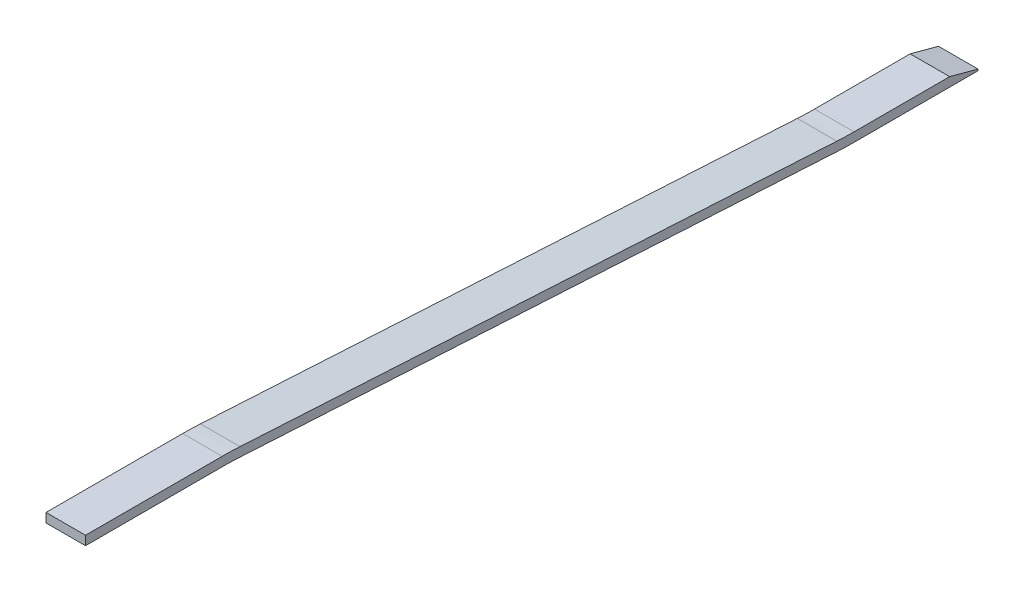
ISO-10303-21;
HEADER;
FILE_DESCRIPTION(('STEP AP214'),'2;1');
FILE_NAME('part.step','',(''),(''),'','','');
FILE_SCHEMA(('AUTOMOTIVE_DESIGN { 1 0 10303 214 1 1 1 1 }'));
ENDSEC;
DATA;
#1=APPLICATION_CONTEXT('core data for automotive mechanical design processes');
#2=APPLICATION_PROTOCOL_DEFINITION('international standard','automotive_design',2000,#1);
#3=PRODUCT_CONTEXT('',#1,'mechanical');
#4=PRODUCT('Part','Part','',(#3));
#5=PRODUCT_RELATED_PRODUCT_CATEGORY('part','',(#4));
#6=PRODUCT_DEFINITION_FORMATION('','',#4);
#7=PRODUCT_DEFINITION_CONTEXT('part definition',#1,'design');
#8=PRODUCT_DEFINITION('design','',#6,#7);
#9=PRODUCT_DEFINITION_SHAPE('','',#8);
#10=(LENGTH_UNIT() NAMED_UNIT(*) SI_UNIT(.MILLI.,.METRE.));
#11=(NAMED_UNIT(*) PLANE_ANGLE_UNIT() SI_UNIT($,.RADIAN.));
#12=(NAMED_UNIT(*) SI_UNIT($,.STERADIAN.) SOLID_ANGLE_UNIT());
#13=UNCERTAINTY_MEASURE_WITH_UNIT(LENGTH_MEASURE(1.E-05),#10,'distance_accuracy_value','');
#14=(GEOMETRIC_REPRESENTATION_CONTEXT(3) GLOBAL_UNCERTAINTY_ASSIGNED_CONTEXT((#13)) GLOBAL_UNIT_ASSIGNED_CONTEXT((#10,
#11,#12)) REPRESENTATION_CONTEXT('',''));
#15=CARTESIAN_POINT('',(0.,0.,0.));
#16=DIRECTION('',(0.,0.,1.));
#17=DIRECTION('',(1.,0.,0.));
#18=AXIS2_PLACEMENT_3D('',#15,#16,#17);
#19=CARTESIAN_POINT('',(6.5,14.,-55.));
#20=DIRECTION('',(0.,0.,-1.));
#21=DIRECTION('',(-1.,0.,0.));
#22=AXIS2_PLACEMENT_3D('',#19,#20,#21);
#23=PLANE('',#22);
#24=DIRECTION('',(0.,-1.,0.));
#25=VECTOR('',#24,1.);
#26=CARTESIAN_POINT('',(-6.5,14.,-55.));
#27=LINE('',#26,#25);
#28=CARTESIAN_POINT('',(-6.5,17.,-55.));
#29=VERTEX_POINT('',#28);
#30=CARTESIAN_POINT('',(-6.5,14.,-55.));
#31=VERTEX_POINT('',#30);
#32=EDGE_CURVE('E129',#29,#31,#27,.T.);
#33=ORIENTED_EDGE('',*,*,#32,.T.);
#34=DIRECTION('',(-1.,0.,0.));
#35=VECTOR('',#34,1.);
#36=CARTESIAN_POINT('',(6.5,14.,-55.));
#37=LINE('',#36,#35);
#38=CARTESIAN_POINT('',(6.5,14.,-55.));
#39=VERTEX_POINT('',#38);
#40=EDGE_CURVE('E11',#39,#31,#37,.T.);
#41=ORIENTED_EDGE('',*,*,#40,.F.);
#42=DIRECTION('',(0.,-1.,0.));
#43=VECTOR('',#42,1.);
#44=CARTESIAN_POINT('',(6.5,14.,-55.));
#45=LINE('',#44,#43);
#46=CARTESIAN_POINT('',(6.5,17.,-55.));
#47=VERTEX_POINT('',#46);
#48=EDGE_CURVE('E166',#47,#39,#45,.T.);
#49=ORIENTED_EDGE('',*,*,#48,.F.);
#50=DIRECTION('',(-1.,0.,0.));
#51=VECTOR('',#50,1.);
#52=CARTESIAN_POINT('',(6.5,17.,-55.));
#53=LINE('',#52,#51);
#54=EDGE_CURVE('E142',#47,#29,#53,.T.);
#55=ORIENTED_EDGE('',*,*,#54,.T.);
#56=EDGE_LOOP('',(#33,#41,#49,#55));
#57=FACE_BOUND('',#56,.T.);
#58=ADVANCED_FACE('F31',(#57),#23,.F.);
#59=CARTESIAN_POINT('',(6.5,14.,-55.));
#60=DIRECTION('',(0.,1.,0.));
#61=DIRECTION('',(0.,0.,1.));
#62=AXIS2_PLACEMENT_3D('',#59,#60,#61);
#63=PLANE('',#62);
#64=DIRECTION('',(0.,0.,-1.));
#65=VECTOR('',#64,1.);
#66=CARTESIAN_POINT('',(-6.5,14.,-55.));
#67=LINE('',#66,#65);
#68=CARTESIAN_POINT('',(-6.5,14.,-100.));
#69=VERTEX_POINT('',#68);
#70=EDGE_CURVE('E125',#31,#69,#67,.T.);
#71=ORIENTED_EDGE('',*,*,#70,.T.);
#72=DIRECTION('',(-1.,0.,0.));
#73=VECTOR('',#72,1.);
#74=CARTESIAN_POINT('',(6.5,14.,-100.));
#75=LINE('',#74,#73);
#76=CARTESIAN_POINT('',(6.5,14.,-100.));
#77=VERTEX_POINT('',#76);
#78=EDGE_CURVE('E38',#77,#69,#75,.T.);
#79=ORIENTED_EDGE('',*,*,#78,.F.);
#80=DIRECTION('',(0.,0.,-1.));
#81=VECTOR('',#80,1.);
#82=CARTESIAN_POINT('',(6.5,14.,-55.));
#83=LINE('',#82,#81);
#84=EDGE_CURVE('E138',#39,#77,#83,.T.);
#85=ORIENTED_EDGE('',*,*,#84,.F.);
#86=ORIENTED_EDGE('',*,*,#40,.T.);
#87=EDGE_LOOP('',(#71,#79,#85,#86));
#88=FACE_BOUND('',#87,.T.);
#89=ADVANCED_FACE('F137',(#88),#63,.F.);
#90=CARTESIAN_POINT('',(6.5,-86.,-100.));
#91=DIRECTION('',(-1.,0.,0.));
#92=DIRECTION('',(0.,0.,1.));
#93=AXIS2_PLACEMENT_3D('',#90,#91,#92);
#94=CYLINDRICAL_SURFACE('',#93,100.);
#95=CARTESIAN_POINT('',(-6.5,-86.,-100.));
#96=DIRECTION('',(-1.,0.,0.));
#97=DIRECTION('',(0.,0.,1.));
#98=AXIS2_PLACEMENT_3D('',#95,#96,#97);
#99=CIRCLE('',#98,100.);
#100=CARTESIAN_POINT('',(-6.5,13.8387088313527,-105.677342590365));
#101=VERTEX_POINT('',#100);
#102=EDGE_CURVE('E131',#69,#101,#99,.T.);
#103=ORIENTED_EDGE('',*,*,#102,.T.);
#104=DIRECTION('',(-1.,0.,0.));
#105=VECTOR('',#104,1.);
#106=CARTESIAN_POINT('',(6.5,13.8387088313527,-105.677342590365));
#107=LINE('',#106,#105);
#108=CARTESIAN_POINT('',(6.5,13.8387088313527,-105.677342590365));
#109=VERTEX_POINT('',#108);
#110=EDGE_CURVE('E217',#109,#101,#107,.T.);
#111=ORIENTED_EDGE('',*,*,#110,.F.);
#112=CARTESIAN_POINT('',(6.5,-86.,-100.));
#113=DIRECTION('',(-1.,0.,0.));
#114=DIRECTION('',(0.,0.,1.));
#115=AXIS2_PLACEMENT_3D('',#112,#113,#114);
#116=CIRCLE('',#115,100.);
#117=EDGE_CURVE('E169',#77,#109,#116,.T.);
#118=ORIENTED_EDGE('',*,*,#117,.F.);
#119=ORIENTED_EDGE('',*,*,#78,.T.);
#120=EDGE_LOOP('',(#103,#111,#118,#119));
#121=FACE_BOUND('',#120,.T.);
#122=ADVANCED_FACE('F221',(#121),#94,.F.);
#123=CARTESIAN_POINT('',(6.5,13.8387088313527,-105.677342590365));
#124=DIRECTION('',(0.,0.998387088313527,-0.0567734259036518));
#125=DIRECTION('',(0.,0.0567734259036518,0.998387088313527));
#126=AXIS2_PLACEMENT_3D('',#123,#124,#125);
#127=PLANE('',#126);
#128=DIRECTION('',(0.,-0.0567734259036518,-0.998387088313527));
#129=VECTOR('',#128,1.);
#130=CARTESIAN_POINT('',(-6.5,13.8387088313527,-105.677342590365));
#131=LINE('',#130,#129);
#132=CARTESIAN_POINT('',(-6.5,2.66612990370668,-302.152337131924));
#133=VERTEX_POINT('',#132);
#134=EDGE_CURVE('E146',#101,#133,#131,.T.);
#135=ORIENTED_EDGE('',*,*,#134,.T.);
#136=DIRECTION('',(-1.,0.,0.));
#137=VECTOR('',#136,1.);
#138=CARTESIAN_POINT('',(6.5,2.66612990370668,-302.152337131924));
#139=LINE('',#138,#137);
#140=CARTESIAN_POINT('',(6.5,2.66612990370668,-302.152337131924));
#141=VERTEX_POINT('',#140);
#142=EDGE_CURVE('E214',#141,#133,#139,.T.);
#143=ORIENTED_EDGE('',*,*,#142,.F.);
#144=DIRECTION('',(0.,-0.0567734259036518,-0.998387088313527));
#145=VECTOR('',#144,1.);
#146=CARTESIAN_POINT('',(6.5,13.8387088313527,-105.677342590365));
#147=LINE('',#146,#145);
#148=EDGE_CURVE('E171',#109,#141,#147,.T.);
#149=ORIENTED_EDGE('',*,*,#148,.F.);
#150=ORIENTED_EDGE('',*,*,#110,.T.);
#151=EDGE_LOOP('',(#135,#143,#149,#150));
#152=FACE_BOUND('',#151,.T.);
#153=ADVANCED_FACE('F229',(#152),#127,.F.);
#154=CARTESIAN_POINT('',(6.5,105.5,-308.));
#155=DIRECTION('',(-1.,0.,0.));
#156=DIRECTION('',(0.,0.,1.));
#157=AXIS2_PLACEMENT_3D('',#154,#155,#156);
#158=CYLINDRICAL_SURFACE('',#157,103.);
#159=CARTESIAN_POINT('',(-6.5,105.5,-308.));
#160=DIRECTION('',(1.,0.,0.));
#161=DIRECTION('',(0.,0.,-1.));
#162=AXIS2_PLACEMENT_3D('',#159,#160,#161);
#163=CIRCLE('',#162,103.);
#164=CARTESIAN_POINT('',(-6.5,2.49999999999999,-308.));
#165=VERTEX_POINT('',#164);
#166=EDGE_CURVE('E148',#133,#165,#163,.T.);
#167=ORIENTED_EDGE('',*,*,#166,.T.);
#168=DIRECTION('',(-1.,0.,0.));
#169=VECTOR('',#168,1.);
#170=CARTESIAN_POINT('',(6.5,2.49999999999999,-308.));
#171=LINE('',#170,#169);
#172=CARTESIAN_POINT('',(6.5,2.49999999999999,-308.));
#173=VERTEX_POINT('',#172);
#174=EDGE_CURVE('E211',#173,#165,#171,.T.);
#175=ORIENTED_EDGE('',*,*,#174,.F.);
#176=CARTESIAN_POINT('',(6.5,105.5,-308.));
#177=DIRECTION('',(1.,0.,0.));
#178=DIRECTION('',(0.,0.,-1.));
#179=AXIS2_PLACEMENT_3D('',#176,#177,#178);
#180=CIRCLE('',#179,103.);
#181=EDGE_CURVE('E173',#141,#173,#180,.T.);
#182=ORIENTED_EDGE('',*,*,#181,.F.);
#183=ORIENTED_EDGE('',*,*,#142,.T.);
#184=EDGE_LOOP('',(#167,#175,#182,#183));
#185=FACE_BOUND('',#184,.T.);
#186=ADVANCED_FACE('F232',(#185),#158,.T.);
#187=CARTESIAN_POINT('',(6.5,2.5,-308.));
#188=DIRECTION('',(0.,1.,0.));
#189=DIRECTION('',(0.,0.,1.));
#190=AXIS2_PLACEMENT_3D('',#187,#188,#189);
#191=PLANE('',#190);
#192=DIRECTION('',(0.,0.,-1.));
#193=VECTOR('',#192,1.);
#194=CARTESIAN_POINT('',(-6.5,2.5,-308.));
#195=LINE('',#194,#193);
#196=CARTESIAN_POINT('',(-6.5,2.5,-348.803847577293));
#197=VERTEX_POINT('',#196);
#198=EDGE_CURVE('E150',#165,#197,#195,.T.);
#199=ORIENTED_EDGE('',*,*,#198,.T.);
#200=DIRECTION('',(-1.,0.,0.));
#201=VECTOR('',#200,1.);
#202=CARTESIAN_POINT('',(6.5,2.5,-348.803847577293));
#203=LINE('',#202,#201);
#204=CARTESIAN_POINT('',(6.5,2.5,-348.803847577293));
#205=VERTEX_POINT('',#204);
#206=EDGE_CURVE('E208',#205,#197,#203,.T.);
#207=ORIENTED_EDGE('',*,*,#206,.F.);
#208=DIRECTION('',(0.,0.,-1.));
#209=VECTOR('',#208,1.);
#210=CARTESIAN_POINT('',(6.5,2.5,-308.));
#211=LINE('',#210,#209);
#212=EDGE_CURVE('E175',#173,#205,#211,.T.);
#213=ORIENTED_EDGE('',*,*,#212,.F.);
#214=ORIENTED_EDGE('',*,*,#174,.T.);
#215=EDGE_LOOP('',(#199,#207,#213,#214));
#216=FACE_BOUND('',#215,.T.);
#217=ADVANCED_FACE('F237',(#216),#191,.F.);
#218=CARTESIAN_POINT('',(6.5,2.5,-348.803847577293));
#219=DIRECTION('',(0.,0.,1.));
#220=DIRECTION('',(1.,0.,0.));
#221=AXIS2_PLACEMENT_3D('',#218,#219,#220);
#222=PLANE('',#221);
#223=DIRECTION('',(0.,1.,0.));
#224=VECTOR('',#223,1.);
#225=CARTESIAN_POINT('',(-6.5,2.5,-348.803847577293));
#226=LINE('',#225,#224);
#227=CARTESIAN_POINT('',(-6.5,3.,-348.803847577293));
#228=VERTEX_POINT('',#227);
#229=EDGE_CURVE('E152',#197,#228,#226,.T.);
#230=ORIENTED_EDGE('',*,*,#229,.T.);
#231=DIRECTION('',(-1.,0.,0.));
#232=VECTOR('',#231,1.);
#233=CARTESIAN_POINT('',(6.5,3.,-348.803847577293));
#234=LINE('',#233,#232);
#235=CARTESIAN_POINT('',(6.5,3.,-348.803847577293));
#236=VERTEX_POINT('',#235);
#237=EDGE_CURVE('E205',#236,#228,#234,.T.);
#238=ORIENTED_EDGE('',*,*,#237,.F.);
#239=DIRECTION('',(0.,1.,0.));
#240=VECTOR('',#239,1.);
#241=CARTESIAN_POINT('',(6.5,2.5,-348.803847577293));
#242=LINE('',#241,#240);
#243=EDGE_CURVE('E177',#205,#236,#242,.T.);
#244=ORIENTED_EDGE('',*,*,#243,.F.);
#245=ORIENTED_EDGE('',*,*,#206,.T.);
#246=EDGE_LOOP('',(#230,#238,#244,#245));
#247=FACE_BOUND('',#246,.T.);
#248=ADVANCED_FACE('F243',(#247),#222,.F.);
#249=CARTESIAN_POINT('',(6.5,3.,-348.803847577293));
#250=DIRECTION('',(0.,-0.96592582628907,0.258819045102515));
#251=DIRECTION('',(0.,-0.258819045102515,-0.96592582628907));
#252=AXIS2_PLACEMENT_3D('',#249,#250,#251);
#253=PLANE('',#252);
#254=DIRECTION('',(0.,0.258819045102515,0.96592582628907));
#255=VECTOR('',#254,1.);
#256=CARTESIAN_POINT('',(-6.5,3.,-348.803847577293));
#257=LINE('',#256,#255);
#258=CARTESIAN_POINT('',(-6.5,5.49999999999999,-339.473720558371));
#259=VERTEX_POINT('',#258);
#260=EDGE_CURVE('E154',#228,#259,#257,.T.);
#261=ORIENTED_EDGE('',*,*,#260,.T.);
#262=DIRECTION('',(-1.,0.,0.));
#263=VECTOR('',#262,1.);
#264=CARTESIAN_POINT('',(6.5,5.49999999999999,-339.473720558371));
#265=LINE('',#264,#263);
#266=CARTESIAN_POINT('',(6.5,5.49999999999999,-339.473720558371));
#267=VERTEX_POINT('',#266);
#268=EDGE_CURVE('E202',#267,#259,#265,.T.);
#269=ORIENTED_EDGE('',*,*,#268,.F.);
#270=DIRECTION('',(0.,0.258819045102515,0.96592582628907));
#271=VECTOR('',#270,1.);
#272=CARTESIAN_POINT('',(6.5,3.,-348.803847577293));
#273=LINE('',#272,#271);
#274=EDGE_CURVE('E179',#236,#267,#273,.T.);
#275=ORIENTED_EDGE('',*,*,#274,.F.);
#276=ORIENTED_EDGE('',*,*,#237,.T.);
#277=EDGE_LOOP('',(#261,#269,#275,#276));
#278=FACE_BOUND('',#277,.T.);
#279=ADVANCED_FACE('F247',(#278),#253,.F.);
#280=CARTESIAN_POINT('',(6.5,5.49999999999998,-308.));
#281=DIRECTION('',(0.,-1.,0.));
#282=DIRECTION('',(0.,0.,-1.));
#283=AXIS2_PLACEMENT_3D('',#280,#281,#282);
#284=PLANE('',#283);
#285=DIRECTION('',(0.,0.,1.));
#286=VECTOR('',#285,1.);
#287=CARTESIAN_POINT('',(-6.5,5.49999999999998,-308.));
#288=LINE('',#287,#286);
#289=CARTESIAN_POINT('',(-6.5,5.49999999999998,-308.));
#290=VERTEX_POINT('',#289);
#291=EDGE_CURVE('E156',#259,#290,#288,.T.);
#292=ORIENTED_EDGE('',*,*,#291,.T.);
#293=DIRECTION('',(-1.,0.,0.));
#294=VECTOR('',#293,1.);
#295=CARTESIAN_POINT('',(6.5,5.49999999999998,-308.));
#296=LINE('',#295,#294);
#297=CARTESIAN_POINT('',(6.5,5.49999999999998,-308.));
#298=VERTEX_POINT('',#297);
#299=EDGE_CURVE('E199',#298,#290,#296,.T.);
#300=ORIENTED_EDGE('',*,*,#299,.F.);
#301=DIRECTION('',(0.,0.,1.));
#302=VECTOR('',#301,1.);
#303=CARTESIAN_POINT('',(6.5,5.49999999999998,-308.));
#304=LINE('',#303,#302);
#305=EDGE_CURVE('E181',#267,#298,#304,.T.);
#306=ORIENTED_EDGE('',*,*,#305,.F.);
#307=ORIENTED_EDGE('',*,*,#268,.T.);
#308=EDGE_LOOP('',(#292,#300,#306,#307));
#309=FACE_BOUND('',#308,.T.);
#310=ADVANCED_FACE('F252',(#309),#284,.F.);
#311=CARTESIAN_POINT('',(6.5,105.5,-308.));
#312=DIRECTION('',(-1.,0.,0.));
#313=DIRECTION('',(0.,0.,1.));
#314=AXIS2_PLACEMENT_3D('',#311,#312,#313);
#315=CYLINDRICAL_SURFACE('',#314,100.);
#316=CARTESIAN_POINT('',(-6.5,105.5,-308.));
#317=DIRECTION('',(-1.,0.,0.));
#318=DIRECTION('',(0.,0.,-1.));
#319=AXIS2_PLACEMENT_3D('',#316,#317,#318);
#320=CIRCLE('',#319,100.);
#321=CARTESIAN_POINT('',(-6.5,5.66129116864729,-302.322657409635));
#322=VERTEX_POINT('',#321);
#323=EDGE_CURVE('E158',#290,#322,#320,.T.);
#324=ORIENTED_EDGE('',*,*,#323,.T.);
#325=DIRECTION('',(-1.,0.,0.));
#326=VECTOR('',#325,1.);
#327=CARTESIAN_POINT('',(6.5,5.66129116864729,-302.322657409635));
#328=LINE('',#327,#326);
#329=CARTESIAN_POINT('',(6.5,5.66129116864729,-302.322657409635));
#330=VERTEX_POINT('',#329);
#331=EDGE_CURVE('E196',#330,#322,#328,.T.);
#332=ORIENTED_EDGE('',*,*,#331,.F.);
#333=CARTESIAN_POINT('',(6.5,105.5,-308.));
#334=DIRECTION('',(-1.,0.,0.));
#335=DIRECTION('',(0.,0.,-1.));
#336=AXIS2_PLACEMENT_3D('',#333,#334,#335);
#337=CIRCLE('',#336,100.);
#338=EDGE_CURVE('E183',#298,#330,#337,.T.);
#339=ORIENTED_EDGE('',*,*,#338,.F.);
#340=ORIENTED_EDGE('',*,*,#299,.T.);
#341=EDGE_LOOP('',(#324,#332,#339,#340));
#342=FACE_BOUND('',#341,.T.);
#343=ADVANCED_FACE('F258',(#342),#315,.F.);
#344=CARTESIAN_POINT('',(6.5,16.8338700962933,-105.847662868076));
#345=DIRECTION('',(0.,-0.998387088313527,0.0567734259036518));
#346=DIRECTION('',(0.,-0.0567734259036518,-0.998387088313527));
#347=AXIS2_PLACEMENT_3D('',#344,#345,#346);
#348=PLANE('',#347);
#349=DIRECTION('',(0.,0.0567734259036518,0.998387088313527));
#350=VECTOR('',#349,1.);
#351=CARTESIAN_POINT('',(-6.5,16.8338700962933,-105.847662868076));
#352=LINE('',#351,#350);
#353=CARTESIAN_POINT('',(-6.5,16.8338700962933,-105.847662868076));
#354=VERTEX_POINT('',#353);
#355=EDGE_CURVE('E160',#322,#354,#352,.T.);
#356=ORIENTED_EDGE('',*,*,#355,.T.);
#357=DIRECTION('',(-1.,0.,0.));
#358=VECTOR('',#357,1.);
#359=CARTESIAN_POINT('',(6.5,16.8338700962933,-105.847662868076));
#360=LINE('',#359,#358);
#361=CARTESIAN_POINT('',(6.5,16.8338700962933,-105.847662868076));
#362=VERTEX_POINT('',#361);
#363=EDGE_CURVE('E193',#362,#354,#360,.T.);
#364=ORIENTED_EDGE('',*,*,#363,.F.);
#365=DIRECTION('',(0.,0.0567734259036518,0.998387088313527));
#366=VECTOR('',#365,1.);
#367=CARTESIAN_POINT('',(6.5,16.8338700962933,-105.847662868076));
#368=LINE('',#367,#366);
#369=EDGE_CURVE('E185',#330,#362,#368,.T.);
#370=ORIENTED_EDGE('',*,*,#369,.F.);
#371=ORIENTED_EDGE('',*,*,#331,.T.);
#372=EDGE_LOOP('',(#356,#364,#370,#371));
#373=FACE_BOUND('',#372,.T.);
#374=ADVANCED_FACE('F262',(#373),#348,.F.);
#375=CARTESIAN_POINT('',(6.5,-86.,-100.));
#376=DIRECTION('',(-1.,0.,0.));
#377=DIRECTION('',(0.,0.,1.));
#378=AXIS2_PLACEMENT_3D('',#375,#376,#377);
#379=CYLINDRICAL_SURFACE('',#378,103.);
#380=CARTESIAN_POINT('',(-6.5,-86.,-100.));
#381=DIRECTION('',(1.,0.,0.));
#382=DIRECTION('',(0.,0.,1.));
#383=AXIS2_PLACEMENT_3D('',#380,#381,#382);
#384=CIRCLE('',#383,103.);
#385=CARTESIAN_POINT('',(-6.5,17.,-100.));
#386=VERTEX_POINT('',#385);
#387=EDGE_CURVE('E162',#354,#386,#384,.T.);
#388=ORIENTED_EDGE('',*,*,#387,.T.);
#389=DIRECTION('',(-1.,0.,0.));
#390=VECTOR('',#389,1.);
#391=CARTESIAN_POINT('',(6.5,17.,-100.));
#392=LINE('',#391,#390);
#393=CARTESIAN_POINT('',(6.5,17.,-100.));
#394=VERTEX_POINT('',#393);
#395=EDGE_CURVE('E190',#394,#386,#392,.T.);
#396=ORIENTED_EDGE('',*,*,#395,.F.);
#397=CARTESIAN_POINT('',(6.5,-86.,-100.));
#398=DIRECTION('',(1.,0.,0.));
#399=DIRECTION('',(0.,0.,1.));
#400=AXIS2_PLACEMENT_3D('',#397,#398,#399);
#401=CIRCLE('',#400,103.);
#402=EDGE_CURVE('E50',#362,#394,#401,.T.);
#403=ORIENTED_EDGE('',*,*,#402,.F.);
#404=ORIENTED_EDGE('',*,*,#363,.T.);
#405=EDGE_LOOP('',(#388,#396,#403,#404));
#406=FACE_BOUND('',#405,.T.);
#407=ADVANCED_FACE('F265',(#406),#379,.T.);
#408=CARTESIAN_POINT('',(6.5,17.,-55.));
#409=DIRECTION('',(0.,-1.,0.));
#410=DIRECTION('',(0.,0.,-1.));
#411=AXIS2_PLACEMENT_3D('',#408,#409,#410);
#412=PLANE('',#411);
#413=DIRECTION('',(0.,0.,1.));
#414=VECTOR('',#413,1.);
#415=CARTESIAN_POINT('',(-6.5,17.,-55.));
#416=LINE('',#415,#414);
#417=EDGE_CURVE('E164',#386,#29,#416,.T.);
#418=ORIENTED_EDGE('',*,*,#417,.T.);
#419=ORIENTED_EDGE('',*,*,#54,.F.);
#420=DIRECTION('',(0.,0.,1.));
#421=VECTOR('',#420,1.);
#422=CARTESIAN_POINT('',(6.5,17.,-55.));
#423=LINE('',#422,#421);
#424=EDGE_CURVE('E45',#394,#47,#423,.T.);
#425=ORIENTED_EDGE('',*,*,#424,.F.);
#426=ORIENTED_EDGE('',*,*,#395,.T.);
#427=EDGE_LOOP('',(#418,#419,#425,#426));
#428=FACE_BOUND('',#427,.T.);
#429=ADVANCED_FACE('F267',(#428),#412,.F.);
#430=CARTESIAN_POINT('',(6.5,-86.,-100.));
#431=DIRECTION('',(-1.,0.,0.));
#432=DIRECTION('',(0.,0.,1.));
#433=AXIS2_PLACEMENT_3D('',#430,#431,#432);
#434=PLANE('',#433);
#435=ORIENTED_EDGE('',*,*,#48,.T.);
#436=ORIENTED_EDGE('',*,*,#84,.T.);
#437=ORIENTED_EDGE('',*,*,#117,.T.);
#438=ORIENTED_EDGE('',*,*,#148,.T.);
#439=ORIENTED_EDGE('',*,*,#181,.T.);
#440=ORIENTED_EDGE('',*,*,#212,.T.);
#441=ORIENTED_EDGE('',*,*,#243,.T.);
#442=ORIENTED_EDGE('',*,*,#274,.T.);
#443=ORIENTED_EDGE('',*,*,#305,.T.);
#444=ORIENTED_EDGE('',*,*,#338,.T.);
#445=ORIENTED_EDGE('',*,*,#369,.T.);
#446=ORIENTED_EDGE('',*,*,#402,.T.);
#447=ORIENTED_EDGE('',*,*,#424,.T.);
#448=EDGE_LOOP('',(#435,#436,#437,#438,#439,#440,#441,#442,#443,#444,#445,#446,#447));
#449=FACE_BOUND('',#448,.T.);
#450=ADVANCED_FACE('F224',(#449),#434,.F.);
#451=CARTESIAN_POINT('',(-6.5,-86.,-100.));
#452=DIRECTION('',(-1.,0.,0.));
#453=DIRECTION('',(0.,0.,1.));
#454=AXIS2_PLACEMENT_3D('',#451,#452,#453);
#455=PLANE('',#454);
#456=ORIENTED_EDGE('',*,*,#32,.F.);
#457=ORIENTED_EDGE('',*,*,#417,.F.);
#458=ORIENTED_EDGE('',*,*,#387,.F.);
#459=ORIENTED_EDGE('',*,*,#355,.F.);
#460=ORIENTED_EDGE('',*,*,#323,.F.);
#461=ORIENTED_EDGE('',*,*,#291,.F.);
#462=ORIENTED_EDGE('',*,*,#260,.F.);
#463=ORIENTED_EDGE('',*,*,#229,.F.);
#464=ORIENTED_EDGE('',*,*,#198,.F.);
#465=ORIENTED_EDGE('',*,*,#166,.F.);
#466=ORIENTED_EDGE('',*,*,#134,.F.);
#467=ORIENTED_EDGE('',*,*,#102,.F.);
#468=ORIENTED_EDGE('',*,*,#70,.F.);
#469=EDGE_LOOP('',(#456,#457,#458,#459,#460,#461,#462,#463,#464,#465,#466,#467,#468));
#470=FACE_BOUND('',#469,.T.);
#471=ADVANCED_FACE('F126',(#470),#455,.T.);
#472=CLOSED_SHELL('',(#58,#89,#122,#153,#186,#217,#248,#279,#310,#343,#374,#407,#429,#450,#471));
#473=MANIFOLD_SOLID_BREP('B2',#472);
#474=ADVANCED_BREP_SHAPE_REPRESENTATION('',(#18,#473),#14);
#475=SHAPE_DEFINITION_REPRESENTATION(#9,#474);
ENDSEC;
END-ISO-10303-21;
